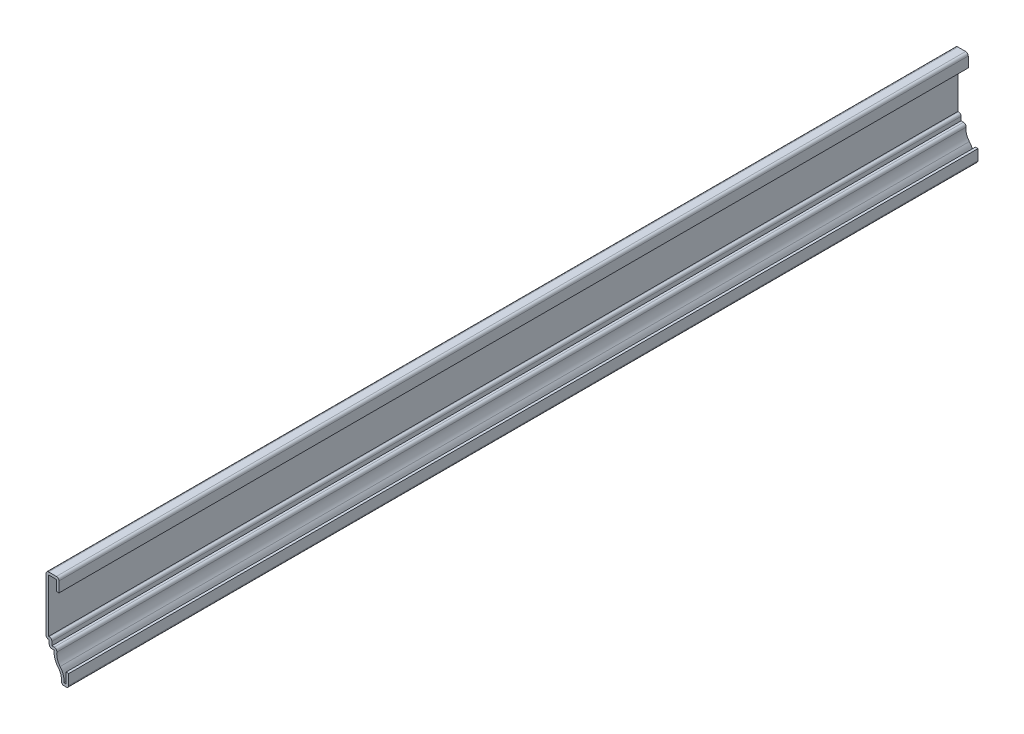
ISO-10303-21;
HEADER;
FILE_DESCRIPTION(('STEP AP214'),'2;1');
FILE_NAME('part.step','',(''),(''),'','','');
FILE_SCHEMA(('AUTOMOTIVE_DESIGN { 1 0 10303 214 1 1 1 1 }'));
ENDSEC;
DATA;
#1=APPLICATION_CONTEXT('core data for automotive mechanical design processes');
#2=APPLICATION_PROTOCOL_DEFINITION('international standard','automotive_design',2000,#1);
#3=PRODUCT_CONTEXT('',#1,'mechanical');
#4=PRODUCT('Part','Part','',(#3));
#5=PRODUCT_RELATED_PRODUCT_CATEGORY('part','',(#4));
#6=PRODUCT_DEFINITION_FORMATION('','',#4);
#7=PRODUCT_DEFINITION_CONTEXT('part definition',#1,'design');
#8=PRODUCT_DEFINITION('design','',#6,#7);
#9=PRODUCT_DEFINITION_SHAPE('','',#8);
#10=(LENGTH_UNIT() NAMED_UNIT(*) SI_UNIT(.MILLI.,.METRE.));
#11=(NAMED_UNIT(*) PLANE_ANGLE_UNIT() SI_UNIT($,.RADIAN.));
#12=(NAMED_UNIT(*) SI_UNIT($,.STERADIAN.) SOLID_ANGLE_UNIT());
#13=UNCERTAINTY_MEASURE_WITH_UNIT(LENGTH_MEASURE(1.E-05),#10,'distance_accuracy_value','');
#14=(GEOMETRIC_REPRESENTATION_CONTEXT(3) GLOBAL_UNCERTAINTY_ASSIGNED_CONTEXT((#13)) GLOBAL_UNIT_ASSIGNED_CONTEXT((#10,
#11,#12)) REPRESENTATION_CONTEXT('',''));
#15=CARTESIAN_POINT('',(0.,0.,0.));
#16=DIRECTION('',(0.,0.,1.));
#17=DIRECTION('',(1.,0.,0.));
#18=AXIS2_PLACEMENT_3D('',#15,#16,#17);
#19=CARTESIAN_POINT('',(-6.0325,44.45,-444.5));
#20=DIRECTION('',(-1.,0.,0.));
#21=DIRECTION('',(0.,-1.,0.));
#22=AXIS2_PLACEMENT_3D('',#19,#20,#21);
#23=PLANE('',#22);
#24=DIRECTION('',(0.,-1.,0.));
#25=VECTOR('',#24,1.);
#26=CARTESIAN_POINT('',(-6.0325,44.45,0.));
#27=LINE('',#26,#25);
#28=CARTESIAN_POINT('',(-6.0325,43.18,0.));
#29=VERTEX_POINT('',#28);
#30=CARTESIAN_POINT('',(-6.0325,38.1,0.));
#31=VERTEX_POINT('',#30);
#32=EDGE_CURVE('E312',#29,#31,#27,.T.);
#33=ORIENTED_EDGE('',*,*,#32,.F.);
#34=DIRECTION('',(0.,0.,1.));
#35=VECTOR('',#34,1.);
#36=CARTESIAN_POINT('',(-6.0325,43.18,-444.5));
#37=LINE('',#36,#35);
#38=CARTESIAN_POINT('',(-6.0325,43.18,-444.5));
#39=VERTEX_POINT('',#38);
#40=EDGE_CURVE('E257',#39,#29,#37,.T.);
#41=ORIENTED_EDGE('',*,*,#40,.F.);
#42=DIRECTION('',(0.,-1.,0.));
#43=VECTOR('',#42,1.);
#44=CARTESIAN_POINT('',(-6.0325,44.45,-444.5));
#45=LINE('',#44,#43);
#46=CARTESIAN_POINT('',(-6.0325,38.1,-444.5));
#47=VERTEX_POINT('',#46);
#48=EDGE_CURVE('E239',#39,#47,#45,.T.);
#49=ORIENTED_EDGE('',*,*,#48,.T.);
#50=DIRECTION('',(0.,0.,1.));
#51=VECTOR('',#50,1.);
#52=CARTESIAN_POINT('',(-6.0325,38.1,-444.5));
#53=LINE('',#52,#51);
#54=EDGE_CURVE('E247',#47,#31,#53,.T.);
#55=ORIENTED_EDGE('',*,*,#54,.T.);
#56=EDGE_LOOP('',(#33,#41,#49,#55));
#57=FACE_BOUND('',#56,.T.);
#58=ADVANCED_FACE('F35',(#57),#23,.T.);
#59=CARTESIAN_POINT('',(-11.1125,43.18,-444.5));
#60=DIRECTION('',(0.,-1.,0.));
#61=DIRECTION('',(1.,0.,0.));
#62=AXIS2_PLACEMENT_3D('',#59,#60,#61);
#63=PLANE('',#62);
#64=DIRECTION('',(1.,0.,0.));
#65=VECTOR('',#64,1.);
#66=CARTESIAN_POINT('',(-11.1125,43.18,0.));
#67=LINE('',#66,#65);
#68=CARTESIAN_POINT('',(-9.8425,43.18,0.));
#69=VERTEX_POINT('',#68);
#70=EDGE_CURVE('E258',#69,#29,#67,.T.);
#71=ORIENTED_EDGE('',*,*,#70,.F.);
#72=DIRECTION('',(0.,0.,1.));
#73=VECTOR('',#72,1.);
#74=CARTESIAN_POINT('',(-9.8425,43.18,-444.5));
#75=LINE('',#74,#73);
#76=CARTESIAN_POINT('',(-9.8425,43.18,-444.5));
#77=VERTEX_POINT('',#76);
#78=EDGE_CURVE('E365',#77,#69,#75,.T.);
#79=ORIENTED_EDGE('',*,*,#78,.F.);
#80=DIRECTION('',(1.,0.,0.));
#81=VECTOR('',#80,1.);
#82=CARTESIAN_POINT('',(-11.1125,43.18,-444.5));
#83=LINE('',#82,#81);
#84=EDGE_CURVE('E255',#77,#39,#83,.T.);
#85=ORIENTED_EDGE('',*,*,#84,.T.);
#86=ORIENTED_EDGE('',*,*,#40,.T.);
#87=EDGE_LOOP('',(#71,#79,#85,#86));
#88=FACE_BOUND('',#87,.T.);
#89=ADVANCED_FACE('F474',(#88),#63,.T.);
#90=CARTESIAN_POINT('',(-9.8425,15.875,-444.5));
#91=DIRECTION('',(1.,0.,0.));
#92=DIRECTION('',(0.,0.,-1.));
#93=AXIS2_PLACEMENT_3D('',#90,#91,#92);
#94=PLANE('',#93);
#95=DIRECTION('',(0.,1.,0.));
#96=VECTOR('',#95,1.);
#97=CARTESIAN_POINT('',(-9.8425,15.875,0.));
#98=LINE('',#97,#96);
#99=CARTESIAN_POINT('',(-9.8425,17.145,0.));
#100=VERTEX_POINT('',#99);
#101=EDGE_CURVE('E261',#100,#69,#98,.T.);
#102=ORIENTED_EDGE('',*,*,#101,.F.);
#103=DIRECTION('',(0.,0.,1.));
#104=VECTOR('',#103,1.);
#105=CARTESIAN_POINT('',(-9.8425,17.145,-444.5));
#106=LINE('',#105,#104);
#107=CARTESIAN_POINT('',(-9.8425,17.145,-444.5));
#108=VERTEX_POINT('',#107);
#109=EDGE_CURVE('E367',#108,#100,#106,.T.);
#110=ORIENTED_EDGE('',*,*,#109,.F.);
#111=DIRECTION('',(0.,1.,0.));
#112=VECTOR('',#111,1.);
#113=CARTESIAN_POINT('',(-9.8425,15.875,-444.5));
#114=LINE('',#113,#112);
#115=EDGE_CURVE('E308',#108,#77,#114,.T.);
#116=ORIENTED_EDGE('',*,*,#115,.T.);
#117=ORIENTED_EDGE('',*,*,#78,.T.);
#118=EDGE_LOOP('',(#102,#110,#116,#117));
#119=FACE_BOUND('',#118,.T.);
#120=ADVANCED_FACE('F480',(#119),#94,.T.);
#121=CARTESIAN_POINT('',(-9.525,17.145,-444.5));
#122=DIRECTION('',(0.,1.,0.));
#123=DIRECTION('',(-1.,0.,0.));
#124=AXIS2_PLACEMENT_3D('',#121,#122,#123);
#125=PLANE('',#124);
#126=DIRECTION('',(-1.,0.,0.));
#127=VECTOR('',#126,1.);
#128=CARTESIAN_POINT('',(-9.525,17.145,0.));
#129=LINE('',#128,#127);
#130=CARTESIAN_POINT('',(-9.525,17.145,0.));
#131=VERTEX_POINT('',#130);
#132=EDGE_CURVE('E359',#131,#100,#129,.T.);
#133=ORIENTED_EDGE('',*,*,#132,.F.);
#134=DIRECTION('',(0.,0.,1.));
#135=VECTOR('',#134,1.);
#136=CARTESIAN_POINT('',(-9.525,17.145,-444.5));
#137=LINE('',#136,#135);
#138=CARTESIAN_POINT('',(-9.525,17.145,-444.5));
#139=VERTEX_POINT('',#138);
#140=EDGE_CURVE('E447',#131,#139,#137,.F.);
#141=ORIENTED_EDGE('',*,*,#140,.T.);
#142=DIRECTION('',(-1.,0.,0.));
#143=VECTOR('',#142,1.);
#144=CARTESIAN_POINT('',(-9.525,17.145,-444.5));
#145=LINE('',#144,#143);
#146=EDGE_CURVE('E306',#139,#108,#145,.T.);
#147=ORIENTED_EDGE('',*,*,#146,.T.);
#148=ORIENTED_EDGE('',*,*,#109,.T.);
#149=EDGE_LOOP('',(#133,#141,#147,#148));
#150=FACE_BOUND('',#149,.T.);
#151=ADVANCED_FACE('F483',(#150),#125,.T.);
#152=CARTESIAN_POINT('',(-8.255,12.7,-444.5));
#153=DIRECTION('',(1.,0.,0.));
#154=DIRECTION('',(0.,0.,-1.));
#155=AXIS2_PLACEMENT_3D('',#152,#153,#154);
#156=PLANE('',#155);
#157=DIRECTION('',(0.,1.,0.));
#158=VECTOR('',#157,1.);
#159=CARTESIAN_POINT('',(-8.255,12.7,-444.5));
#160=LINE('',#159,#158);
#161=CARTESIAN_POINT('',(-8.255,13.97,-444.5));
#162=VERTEX_POINT('',#161);
#163=CARTESIAN_POINT('',(-8.255,15.875,-444.5));
#164=VERTEX_POINT('',#163);
#165=EDGE_CURVE('E303',#162,#164,#160,.T.);
#166=ORIENTED_EDGE('',*,*,#165,.T.);
#167=DIRECTION('',(0.,0.,1.));
#168=VECTOR('',#167,1.);
#169=CARTESIAN_POINT('',(-8.255,15.875,-444.5));
#170=LINE('',#169,#168);
#171=CARTESIAN_POINT('',(-8.255,15.875,0.));
#172=VERTEX_POINT('',#171);
#173=EDGE_CURVE('E444',#164,#172,#170,.T.);
#174=ORIENTED_EDGE('',*,*,#173,.T.);
#175=DIRECTION('',(0.,1.,0.));
#176=VECTOR('',#175,1.);
#177=CARTESIAN_POINT('',(-8.255,12.7,0.));
#178=LINE('',#177,#176);
#179=CARTESIAN_POINT('',(-8.255,13.97,0.));
#180=VERTEX_POINT('',#179);
#181=EDGE_CURVE('E356',#180,#172,#178,.T.);
#182=ORIENTED_EDGE('',*,*,#181,.F.);
#183=DIRECTION('',(0.,0.,1.));
#184=VECTOR('',#183,1.);
#185=CARTESIAN_POINT('',(-8.255,13.97,-444.5));
#186=LINE('',#185,#184);
#187=EDGE_CURVE('E370',#162,#180,#186,.T.);
#188=ORIENTED_EDGE('',*,*,#187,.F.);
#189=EDGE_LOOP('',(#166,#174,#182,#188));
#190=FACE_BOUND('',#189,.T.);
#191=ADVANCED_FACE('F492',(#190),#156,.T.);
#192=CARTESIAN_POINT('',(-7.07009939362724,13.97,-444.5));
#193=DIRECTION('',(0.,1.,0.));
#194=DIRECTION('',(0.,0.,1.));
#195=AXIS2_PLACEMENT_3D('',#192,#193,#194);
#196=PLANE('',#195);
#197=DIRECTION('',(1.,0.,0.));
#198=VECTOR('',#197,1.);
#199=CARTESIAN_POINT('',(-7.07009939362724,13.97,0.));
#200=LINE('',#199,#198);
#201=CARTESIAN_POINT('',(-7.07009939362724,13.97,0.));
#202=VERTEX_POINT('',#201);
#203=EDGE_CURVE('E354',#202,#180,#200,.F.);
#204=ORIENTED_EDGE('',*,*,#203,.F.);
#205=DIRECTION('',(0.,0.,1.));
#206=VECTOR('',#205,1.);
#207=CARTESIAN_POINT('',(-7.07009939362724,13.97,-444.5));
#208=LINE('',#207,#206);
#209=CARTESIAN_POINT('',(-7.07009939362724,13.97,-444.5));
#210=VERTEX_POINT('',#209);
#211=EDGE_CURVE('E437',#202,#210,#208,.F.);
#212=ORIENTED_EDGE('',*,*,#211,.T.);
#213=DIRECTION('',(1.,0.,0.));
#214=VECTOR('',#213,1.);
#215=CARTESIAN_POINT('',(-7.07009939362724,13.97,-444.5));
#216=LINE('',#215,#214);
#217=EDGE_CURVE('E301',#210,#162,#216,.F.);
#218=ORIENTED_EDGE('',*,*,#217,.T.);
#219=ORIENTED_EDGE('',*,*,#187,.T.);
#220=EDGE_LOOP('',(#204,#212,#218,#219));
#221=FACE_BOUND('',#220,.T.);
#222=ADVANCED_FACE('F496',(#221),#196,.T.);
#223=CARTESIAN_POINT('',(0.79375,11.6212141248846,-444.5));
#224=DIRECTION('',(0.,0.,1.));
#225=DIRECTION('',(1.,0.,0.));
#226=AXIS2_PLACEMENT_3D('',#223,#224,#225);
#227=CYLINDRICAL_SURFACE('',#226,6.6675);
#228=CARTESIAN_POINT('',(0.79375,11.6212141248846,-444.5));
#229=DIRECTION('',(0.,0.,1.));
#230=DIRECTION('',(1.,0.,0.));
#231=AXIS2_PLACEMENT_3D('',#228,#229,#230);
#232=CIRCLE('',#231,6.6675);
#233=CARTESIAN_POINT('',(-4.21157837512634,7.21641627400029,-444.5));
#234=VERTEX_POINT('',#233);
#235=CARTESIAN_POINT('',(-5.81188349064688,12.5273942599815,-444.5));
#236=VERTEX_POINT('',#235);
#237=EDGE_CURVE('E298',#234,#236,#232,.F.);
#238=ORIENTED_EDGE('',*,*,#237,.T.);
#239=DIRECTION('',(0.,0.,1.));
#240=VECTOR('',#239,1.);
#241=CARTESIAN_POINT('',(-5.81188349064688,12.5273942599815,-444.5));
#242=LINE('',#241,#240);
#243=CARTESIAN_POINT('',(-5.81188349064688,12.5273942599815,0.));
#244=VERTEX_POINT('',#243);
#245=EDGE_CURVE('E434',#236,#244,#242,.T.);
#246=ORIENTED_EDGE('',*,*,#245,.T.);
#247=CARTESIAN_POINT('',(0.79375,11.6212141248846,0.));
#248=DIRECTION('',(0.,0.,1.));
#249=DIRECTION('',(1.,0.,0.));
#250=AXIS2_PLACEMENT_3D('',#247,#248,#249);
#251=CIRCLE('',#250,6.6675);
#252=CARTESIAN_POINT('',(-4.21157837512634,7.21641627400029,0.));
#253=VERTEX_POINT('',#252);
#254=EDGE_CURVE('E351',#253,#244,#251,.F.);
#255=ORIENTED_EDGE('',*,*,#254,.F.);
#256=DIRECTION('',(0.,0.,1.));
#257=VECTOR('',#256,1.);
#258=CARTESIAN_POINT('',(-4.21157837512634,7.21641627400029,-444.5));
#259=LINE('',#258,#257);
#260=EDGE_CURVE('E373',#234,#253,#259,.T.);
#261=ORIENTED_EDGE('',*,*,#260,.F.);
#262=EDGE_LOOP('',(#238,#246,#255,#261));
#263=FACE_BOUND('',#262,.T.);
#264=ADVANCED_FACE('F505',(#263),#227,.F.);
#265=CARTESIAN_POINT('',(-9.93195366098501,2.18236158727535,-444.5));
#266=DIRECTION('',(0.,0.,1.));
#267=DIRECTION('',(1.,0.,0.));
#268=AXIS2_PLACEMENT_3D('',#265,#266,#267);
#269=CYLINDRICAL_SURFACE('',#268,7.62);
#270=CARTESIAN_POINT('',(-9.93195366098501,2.18236158727535,0.));
#271=DIRECTION('',(0.,0.,1.));
#272=DIRECTION('',(1.,0.,0.));
#273=AXIS2_PLACEMENT_3D('',#270,#271,#272);
#274=CIRCLE('',#273,7.62);
#275=CARTESIAN_POINT('',(-2.36677049505542,1.27,0.));
#276=VERTEX_POINT('',#275);
#277=EDGE_CURVE('E348',#276,#253,#274,.T.);
#278=ORIENTED_EDGE('',*,*,#277,.F.);
#279=DIRECTION('',(0.,0.,1.));
#280=VECTOR('',#279,1.);
#281=CARTESIAN_POINT('',(-2.36677049505542,1.27,-444.5));
#282=LINE('',#281,#280);
#283=CARTESIAN_POINT('',(-2.36677049505542,1.27,-444.5));
#284=VERTEX_POINT('',#283);
#285=EDGE_CURVE('E375',#284,#276,#282,.T.);
#286=ORIENTED_EDGE('',*,*,#285,.F.);
#287=CARTESIAN_POINT('',(-9.93195366098501,2.18236158727535,-444.5));
#288=DIRECTION('',(0.,0.,1.));
#289=DIRECTION('',(1.,0.,0.));
#290=AXIS2_PLACEMENT_3D('',#287,#288,#289);
#291=CIRCLE('',#290,7.62);
#292=EDGE_CURVE('E295',#284,#234,#291,.T.);
#293=ORIENTED_EDGE('',*,*,#292,.T.);
#294=ORIENTED_EDGE('',*,*,#260,.T.);
#295=EDGE_LOOP('',(#278,#286,#293,#294));
#296=FACE_BOUND('',#295,.T.);
#297=ADVANCED_FACE('F509',(#296),#269,.T.);
#298=CARTESIAN_POINT('',(0.,1.27,-444.5));
#299=DIRECTION('',(0.,1.,0.));
#300=DIRECTION('',(0.,0.,1.));
#301=AXIS2_PLACEMENT_3D('',#298,#299,#300);
#302=PLANE('',#301);
#303=DIRECTION('',(1.,0.,0.));
#304=VECTOR('',#303,1.);
#305=CARTESIAN_POINT('',(0.,1.27,0.));
#306=LINE('',#305,#304);
#307=CARTESIAN_POINT('',(-1.27,1.27,0.));
#308=VERTEX_POINT('',#307);
#309=EDGE_CURVE('E345',#308,#276,#306,.F.);
#310=ORIENTED_EDGE('',*,*,#309,.F.);
#311=DIRECTION('',(0.,0.,1.));
#312=VECTOR('',#311,1.);
#313=CARTESIAN_POINT('',(-1.27,1.27,-444.5));
#314=LINE('',#313,#312);
#315=CARTESIAN_POINT('',(-1.27,1.27,-444.5));
#316=VERTEX_POINT('',#315);
#317=EDGE_CURVE('E377',#316,#308,#314,.T.);
#318=ORIENTED_EDGE('',*,*,#317,.F.);
#319=DIRECTION('',(1.,0.,0.));
#320=VECTOR('',#319,1.);
#321=CARTESIAN_POINT('',(0.,1.27,-444.5));
#322=LINE('',#321,#320);
#323=EDGE_CURVE('E292',#316,#284,#322,.F.);
#324=ORIENTED_EDGE('',*,*,#323,.T.);
#325=ORIENTED_EDGE('',*,*,#285,.T.);
#326=EDGE_LOOP('',(#310,#318,#324,#325));
#327=FACE_BOUND('',#326,.T.);
#328=ADVANCED_FACE('F514',(#327),#302,.T.);
#329=CARTESIAN_POINT('',(-1.27,6.35,-444.5));
#330=DIRECTION('',(-1.,0.,0.));
#331=DIRECTION('',(0.,-1.,0.));
#332=AXIS2_PLACEMENT_3D('',#329,#330,#331);
#333=PLANE('',#332);
#334=DIRECTION('',(0.,-1.,0.));
#335=VECTOR('',#334,1.);
#336=CARTESIAN_POINT('',(-1.27,6.35,0.));
#337=LINE('',#336,#335);
#338=CARTESIAN_POINT('',(-1.27,6.35,0.));
#339=VERTEX_POINT('',#338);
#340=EDGE_CURVE('E342',#339,#308,#337,.T.);
#341=ORIENTED_EDGE('',*,*,#340,.F.);
#342=DIRECTION('',(0.,0.,1.));
#343=VECTOR('',#342,1.);
#344=CARTESIAN_POINT('',(-1.27,6.35,-444.5));
#345=LINE('',#344,#343);
#346=CARTESIAN_POINT('',(-1.27,6.35,-444.5));
#347=VERTEX_POINT('',#346);
#348=EDGE_CURVE('E379',#347,#339,#345,.T.);
#349=ORIENTED_EDGE('',*,*,#348,.F.);
#350=DIRECTION('',(0.,-1.,0.));
#351=VECTOR('',#350,1.);
#352=CARTESIAN_POINT('',(-1.27,6.35,-444.5));
#353=LINE('',#352,#351);
#354=EDGE_CURVE('E289',#347,#316,#353,.T.);
#355=ORIENTED_EDGE('',*,*,#354,.T.);
#356=ORIENTED_EDGE('',*,*,#317,.T.);
#357=EDGE_LOOP('',(#341,#349,#355,#356));
#358=FACE_BOUND('',#357,.T.);
#359=ADVANCED_FACE('F517',(#358),#333,.T.);
#360=CARTESIAN_POINT('',(-1.27,6.35,-444.5));
#361=DIRECTION('',(0.,-1.,0.));
#362=DIRECTION('',(0.,0.,-1.));
#363=AXIS2_PLACEMENT_3D('',#360,#361,#362);
#364=PLANE('',#363);
#365=DIRECTION('',(1.,0.,0.));
#366=VECTOR('',#365,1.);
#367=CARTESIAN_POINT('',(-1.27,6.35,0.));
#368=LINE('',#367,#366);
#369=CARTESIAN_POINT('',(0.,6.35,0.));
#370=VERTEX_POINT('',#369);
#371=EDGE_CURVE('E340',#339,#370,#368,.T.);
#372=ORIENTED_EDGE('',*,*,#371,.T.);
#373=DIRECTION('',(0.,0.,1.));
#374=VECTOR('',#373,1.);
#375=CARTESIAN_POINT('',(0.,6.35,-444.5));
#376=LINE('',#375,#374);
#377=CARTESIAN_POINT('',(0.,6.35,-444.5));
#378=VERTEX_POINT('',#377);
#379=EDGE_CURVE('E381',#378,#370,#376,.T.);
#380=ORIENTED_EDGE('',*,*,#379,.F.);
#381=DIRECTION('',(1.,0.,0.));
#382=VECTOR('',#381,1.);
#383=CARTESIAN_POINT('',(-1.27,6.35,-444.5));
#384=LINE('',#383,#382);
#385=EDGE_CURVE('E287',#347,#378,#384,.T.);
#386=ORIENTED_EDGE('',*,*,#385,.F.);
#387=ORIENTED_EDGE('',*,*,#348,.T.);
#388=EDGE_LOOP('',(#372,#380,#386,#387));
#389=FACE_BOUND('',#388,.T.);
#390=ADVANCED_FACE('F523',(#389),#364,.F.);
#391=CARTESIAN_POINT('',(0.,6.35,-444.5));
#392=DIRECTION('',(-1.,0.,0.));
#393=DIRECTION('',(0.,-1.,0.));
#394=AXIS2_PLACEMENT_3D('',#391,#392,#393);
#395=PLANE('',#394);
#396=DIRECTION('',(0.,-1.,0.));
#397=VECTOR('',#396,1.);
#398=CARTESIAN_POINT('',(0.,6.35,0.));
#399=LINE('',#398,#397);
#400=CARTESIAN_POINT('',(0.,1.27,0.));
#401=VERTEX_POINT('',#400);
#402=EDGE_CURVE('E337',#370,#401,#399,.T.);
#403=ORIENTED_EDGE('',*,*,#402,.T.);
#404=DIRECTION('',(0.,0.,1.));
#405=VECTOR('',#404,1.);
#406=CARTESIAN_POINT('',(0.,1.27,-444.5));
#407=LINE('',#406,#405);
#408=CARTESIAN_POINT('',(0.,1.27,-444.5));
#409=VERTEX_POINT('',#408);
#410=EDGE_CURVE('E414',#401,#409,#407,.F.);
#411=ORIENTED_EDGE('',*,*,#410,.T.);
#412=DIRECTION('',(0.,-1.,0.));
#413=VECTOR('',#412,1.);
#414=CARTESIAN_POINT('',(0.,6.35,-444.5));
#415=LINE('',#414,#413);
#416=EDGE_CURVE('E285',#378,#409,#415,.T.);
#417=ORIENTED_EDGE('',*,*,#416,.F.);
#418=ORIENTED_EDGE('',*,*,#379,.T.);
#419=EDGE_LOOP('',(#403,#411,#417,#418));
#420=FACE_BOUND('',#419,.T.);
#421=ADVANCED_FACE('F527',(#420),#395,.F.);
#422=CARTESIAN_POINT('',(0.,0.,-444.5));
#423=DIRECTION('',(0.,1.,0.));
#424=DIRECTION('',(0.,0.,1.));
#425=AXIS2_PLACEMENT_3D('',#422,#423,#424);
#426=PLANE('',#425);
#427=DIRECTION('',(-1.,0.,0.));
#428=VECTOR('',#427,1.);
#429=CARTESIAN_POINT('',(0.,0.,-444.5));
#430=LINE('',#429,#428);
#431=CARTESIAN_POINT('',(-1.27,0.,-444.5));
#432=VERTEX_POINT('',#431);
#433=CARTESIAN_POINT('',(-2.36677049505542,0.,-444.5));
#434=VERTEX_POINT('',#433);
#435=EDGE_CURVE('E282',#432,#434,#430,.T.);
#436=ORIENTED_EDGE('',*,*,#435,.F.);
#437=DIRECTION('',(0.,0.,1.));
#438=VECTOR('',#437,1.);
#439=CARTESIAN_POINT('',(-1.27,0.,-444.5));
#440=LINE('',#439,#438);
#441=CARTESIAN_POINT('',(-1.27,0.,0.));
#442=VERTEX_POINT('',#441);
#443=EDGE_CURVE('E395',#432,#442,#440,.T.);
#444=ORIENTED_EDGE('',*,*,#443,.T.);
#445=DIRECTION('',(-1.,0.,0.));
#446=VECTOR('',#445,1.);
#447=CARTESIAN_POINT('',(0.,0.,0.));
#448=LINE('',#447,#446);
#449=CARTESIAN_POINT('',(-2.36677049505542,0.,0.));
#450=VERTEX_POINT('',#449);
#451=EDGE_CURVE('E334',#442,#450,#448,.T.);
#452=ORIENTED_EDGE('',*,*,#451,.T.);
#453=DIRECTION('',(0.,0.,1.));
#454=VECTOR('',#453,1.);
#455=CARTESIAN_POINT('',(-2.36677049505542,0.,-444.5));
#456=LINE('',#455,#454);
#457=EDGE_CURVE('E364',#450,#434,#456,.F.);
#458=ORIENTED_EDGE('',*,*,#457,.T.);
#459=EDGE_LOOP('',(#436,#444,#452,#458));
#460=FACE_BOUND('',#459,.T.);
#461=ADVANCED_FACE('F535',(#460),#426,.F.);
#462=CARTESIAN_POINT('',(-9.93195366098501,2.18236158727535,-444.5));
#463=DIRECTION('',(0.,0.,1.));
#464=DIRECTION('',(1.,0.,0.));
#465=AXIS2_PLACEMENT_3D('',#462,#463,#464);
#466=CYLINDRICAL_SURFACE('',#465,6.35);
#467=CARTESIAN_POINT('',(-9.93195366098501,2.18236158727535,-444.5));
#468=DIRECTION('',(0.,0.,1.));
#469=DIRECTION('',(1.,0.,0.));
#470=AXIS2_PLACEMENT_3D('',#467,#468,#469);
#471=CIRCLE('',#470,6.35);
#472=CARTESIAN_POINT('',(-3.62763435604369,1.42206026454589,-444.5));
#473=VERTEX_POINT('',#472);
#474=CARTESIAN_POINT('',(-5.16497425610278,6.37740715954614,-444.5));
#475=VERTEX_POINT('',#474);
#476=EDGE_CURVE('E280',#473,#475,#471,.T.);
#477=ORIENTED_EDGE('',*,*,#476,.F.);
#478=DIRECTION('',(0.,0.,1.));
#479=VECTOR('',#478,1.);
#480=CARTESIAN_POINT('',(-3.62763435604369,1.42206026454589,-444.5));
#481=LINE('',#480,#479);
#482=CARTESIAN_POINT('',(-3.62763435604369,1.42206026454589,0.));
#483=VERTEX_POINT('',#482);
#484=EDGE_CURVE('E431',#473,#483,#481,.T.);
#485=ORIENTED_EDGE('',*,*,#484,.T.);
#486=CARTESIAN_POINT('',(-9.93195366098501,2.18236158727535,0.));
#487=DIRECTION('',(0.,0.,1.));
#488=DIRECTION('',(1.,0.,0.));
#489=AXIS2_PLACEMENT_3D('',#486,#487,#488);
#490=CIRCLE('',#489,6.35);
#491=CARTESIAN_POINT('',(-5.16497425610278,6.37740715954614,0.));
#492=VERTEX_POINT('',#491);
#493=EDGE_CURVE('E332',#483,#492,#490,.T.);
#494=ORIENTED_EDGE('',*,*,#493,.T.);
#495=DIRECTION('',(0.,0.,1.));
#496=VECTOR('',#495,1.);
#497=CARTESIAN_POINT('',(-5.16497425610278,6.37740715954614,-444.5));
#498=LINE('',#497,#496);
#499=EDGE_CURVE('E384',#475,#492,#498,.T.);
#500=ORIENTED_EDGE('',*,*,#499,.F.);
#501=EDGE_LOOP('',(#477,#485,#494,#500));
#502=FACE_BOUND('',#501,.T.);
#503=ADVANCED_FACE('F543',(#502),#466,.F.);
#504=CARTESIAN_POINT('',(0.79375,11.6212141248846,-444.5));
#505=DIRECTION('',(0.,0.,1.));
#506=DIRECTION('',(1.,0.,0.));
#507=AXIS2_PLACEMENT_3D('',#504,#505,#506);
#508=CYLINDRICAL_SURFACE('',#507,7.9375);
#509=CARTESIAN_POINT('',(0.79375,11.6212141248846,0.));
#510=DIRECTION('',(0.,0.,-1.));
#511=DIRECTION('',(-1.,0.,0.));
#512=AXIS2_PLACEMENT_3D('',#509,#510,#511);
#513=CIRCLE('',#512,7.9375);
#514=CARTESIAN_POINT('',(-7.07009939362724,12.7,0.));
#515=VERTEX_POINT('',#514);
#516=EDGE_CURVE('E330',#492,#515,#513,.T.);
#517=ORIENTED_EDGE('',*,*,#516,.T.);
#518=DIRECTION('',(0.,0.,1.));
#519=VECTOR('',#518,1.);
#520=CARTESIAN_POINT('',(-7.07009939362724,12.7,-444.5));
#521=LINE('',#520,#519);
#522=CARTESIAN_POINT('',(-7.07009939362724,12.7,-444.5));
#523=VERTEX_POINT('',#522);
#524=EDGE_CURVE('E387',#523,#515,#521,.T.);
#525=ORIENTED_EDGE('',*,*,#524,.F.);
#526=CARTESIAN_POINT('',(0.79375,11.6212141248846,-444.5));
#527=DIRECTION('',(0.,0.,-1.));
#528=DIRECTION('',(-1.,0.,0.));
#529=AXIS2_PLACEMENT_3D('',#526,#527,#528);
#530=CIRCLE('',#529,7.9375);
#531=EDGE_CURVE('E278',#475,#523,#530,.T.);
#532=ORIENTED_EDGE('',*,*,#531,.F.);
#533=ORIENTED_EDGE('',*,*,#499,.T.);
#534=EDGE_LOOP('',(#517,#525,#532,#533));
#535=FACE_BOUND('',#534,.T.);
#536=ADVANCED_FACE('F549',(#535),#508,.T.);
#537=CARTESIAN_POINT('',(-7.07009939362724,12.7,-444.5));
#538=DIRECTION('',(0.,1.,0.));
#539=DIRECTION('',(0.,0.,1.));
#540=AXIS2_PLACEMENT_3D('',#537,#538,#539);
#541=PLANE('',#540);
#542=DIRECTION('',(-1.,0.,0.));
#543=VECTOR('',#542,1.);
#544=CARTESIAN_POINT('',(-7.07009939362724,12.7,0.));
#545=LINE('',#544,#543);
#546=CARTESIAN_POINT('',(-8.255,12.7,0.));
#547=VERTEX_POINT('',#546);
#548=EDGE_CURVE('E327',#515,#547,#545,.T.);
#549=ORIENTED_EDGE('',*,*,#548,.T.);
#550=DIRECTION('',(0.,0.,1.));
#551=VECTOR('',#550,1.);
#552=CARTESIAN_POINT('',(-8.255,12.7,-444.5));
#553=LINE('',#552,#551);
#554=CARTESIAN_POINT('',(-8.255,12.7,-444.5));
#555=VERTEX_POINT('',#554);
#556=EDGE_CURVE('E442',#547,#555,#553,.F.);
#557=ORIENTED_EDGE('',*,*,#556,.T.);
#558=DIRECTION('',(-1.,0.,0.));
#559=VECTOR('',#558,1.);
#560=CARTESIAN_POINT('',(-7.07009939362724,12.7,-444.5));
#561=LINE('',#560,#559);
#562=EDGE_CURVE('E275',#523,#555,#561,.T.);
#563=ORIENTED_EDGE('',*,*,#562,.F.);
#564=ORIENTED_EDGE('',*,*,#524,.T.);
#565=EDGE_LOOP('',(#549,#557,#563,#564));
#566=FACE_BOUND('',#565,.T.);
#567=ADVANCED_FACE('F700',(#566),#541,.F.);
#568=CARTESIAN_POINT('',(-9.525,12.7,-444.5));
#569=DIRECTION('',(1.,0.,0.));
#570=DIRECTION('',(0.,0.,-1.));
#571=AXIS2_PLACEMENT_3D('',#568,#569,#570);
#572=PLANE('',#571);
#573=DIRECTION('',(0.,1.,0.));
#574=VECTOR('',#573,1.);
#575=CARTESIAN_POINT('',(-9.525,12.7,-444.5));
#576=LINE('',#575,#574);
#577=CARTESIAN_POINT('',(-9.525,13.97,-444.5));
#578=VERTEX_POINT('',#577);
#579=CARTESIAN_POINT('',(-9.525,15.875,-444.5));
#580=VERTEX_POINT('',#579);
#581=EDGE_CURVE('E273',#578,#580,#576,.T.);
#582=ORIENTED_EDGE('',*,*,#581,.F.);
#583=DIRECTION('',(0.,0.,1.));
#584=VECTOR('',#583,1.);
#585=CARTESIAN_POINT('',(-9.525,13.97,-444.5));
#586=LINE('',#585,#584);
#587=CARTESIAN_POINT('',(-9.525,13.97,0.));
#588=VERTEX_POINT('',#587);
#589=EDGE_CURVE('E439',#578,#588,#586,.T.);
#590=ORIENTED_EDGE('',*,*,#589,.T.);
#591=DIRECTION('',(0.,1.,0.));
#592=VECTOR('',#591,1.);
#593=CARTESIAN_POINT('',(-9.525,12.7,0.));
#594=LINE('',#593,#592);
#595=CARTESIAN_POINT('',(-9.525,15.875,0.));
#596=VERTEX_POINT('',#595);
#597=EDGE_CURVE('E325',#588,#596,#594,.T.);
#598=ORIENTED_EDGE('',*,*,#597,.T.);
#599=DIRECTION('',(0.,0.,1.));
#600=VECTOR('',#599,1.);
#601=CARTESIAN_POINT('',(-9.525,15.875,-444.5));
#602=LINE('',#601,#600);
#603=EDGE_CURVE('E390',#580,#596,#602,.T.);
#604=ORIENTED_EDGE('',*,*,#603,.F.);
#605=EDGE_LOOP('',(#582,#590,#598,#604));
#606=FACE_BOUND('',#605,.T.);
#607=ADVANCED_FACE('F560',(#606),#572,.F.);
#608=CARTESIAN_POINT('',(-9.525,15.875,-444.5));
#609=DIRECTION('',(0.,1.,0.));
#610=DIRECTION('',(-1.,0.,0.));
#611=AXIS2_PLACEMENT_3D('',#608,#609,#610);
#612=PLANE('',#611);
#613=DIRECTION('',(-1.,0.,0.));
#614=VECTOR('',#613,1.);
#615=CARTESIAN_POINT('',(-9.525,15.875,0.));
#616=LINE('',#615,#614);
#617=CARTESIAN_POINT('',(-9.8425,15.875,0.));
#618=VERTEX_POINT('',#617);
#619=EDGE_CURVE('E322',#596,#618,#616,.T.);
#620=ORIENTED_EDGE('',*,*,#619,.T.);
#621=DIRECTION('',(0.,0.,1.));
#622=VECTOR('',#621,1.);
#623=CARTESIAN_POINT('',(-9.8425,15.875,-444.5));
#624=LINE('',#623,#622);
#625=CARTESIAN_POINT('',(-9.8425,15.875,-444.5));
#626=VERTEX_POINT('',#625);
#627=EDGE_CURVE('E454',#618,#626,#624,.F.);
#628=ORIENTED_EDGE('',*,*,#627,.T.);
#629=DIRECTION('',(-1.,0.,0.));
#630=VECTOR('',#629,1.);
#631=CARTESIAN_POINT('',(-9.525,15.875,-444.5));
#632=LINE('',#631,#630);
#633=EDGE_CURVE('E270',#580,#626,#632,.T.);
#634=ORIENTED_EDGE('',*,*,#633,.F.);
#635=ORIENTED_EDGE('',*,*,#603,.T.);
#636=EDGE_LOOP('',(#620,#628,#634,#635));
#637=FACE_BOUND('',#636,.T.);
#638=ADVANCED_FACE('F566',(#637),#612,.F.);
#639=CARTESIAN_POINT('',(-11.1125,15.875,-444.5));
#640=DIRECTION('',(1.,0.,0.));
#641=DIRECTION('',(0.,0.,-1.));
#642=AXIS2_PLACEMENT_3D('',#639,#640,#641);
#643=PLANE('',#642);
#644=DIRECTION('',(0.,1.,0.));
#645=VECTOR('',#644,1.);
#646=CARTESIAN_POINT('',(-11.1125,15.875,-444.5));
#647=LINE('',#646,#645);
#648=CARTESIAN_POINT('',(-11.1125,17.145,-444.5));
#649=VERTEX_POINT('',#648);
#650=CARTESIAN_POINT('',(-11.1125,43.18,-444.5));
#651=VERTEX_POINT('',#650);
#652=EDGE_CURVE('E267',#649,#651,#647,.T.);
#653=ORIENTED_EDGE('',*,*,#652,.F.);
#654=DIRECTION('',(0.,0.,1.));
#655=VECTOR('',#654,1.);
#656=CARTESIAN_POINT('',(-11.1125,17.145,-444.5));
#657=LINE('',#656,#655);
#658=CARTESIAN_POINT('',(-11.1125,17.145,0.));
#659=VERTEX_POINT('',#658);
#660=EDGE_CURVE('E451',#649,#659,#657,.T.);
#661=ORIENTED_EDGE('',*,*,#660,.T.);
#662=DIRECTION('',(0.,1.,0.));
#663=VECTOR('',#662,1.);
#664=CARTESIAN_POINT('',(-11.1125,15.875,0.));
#665=LINE('',#664,#663);
#666=CARTESIAN_POINT('',(-11.1125,43.18,0.));
#667=VERTEX_POINT('',#666);
#668=EDGE_CURVE('E319',#659,#667,#665,.T.);
#669=ORIENTED_EDGE('',*,*,#668,.T.);
#670=DIRECTION('',(0.,0.,1.));
#671=VECTOR('',#670,1.);
#672=CARTESIAN_POINT('',(-11.1125,43.18,-444.5));
#673=LINE('',#672,#671);
#674=EDGE_CURVE('E449',#667,#651,#673,.F.);
#675=ORIENTED_EDGE('',*,*,#674,.T.);
#676=EDGE_LOOP('',(#653,#661,#669,#675));
#677=FACE_BOUND('',#676,.T.);
#678=ADVANCED_FACE('F574',(#677),#643,.F.);
#679=CARTESIAN_POINT('',(-11.1125,44.45,-444.5));
#680=DIRECTION('',(0.,-1.,0.));
#681=DIRECTION('',(1.,0.,0.));
#682=AXIS2_PLACEMENT_3D('',#679,#680,#681);
#683=PLANE('',#682);
#684=DIRECTION('',(1.,0.,0.));
#685=VECTOR('',#684,1.);
#686=CARTESIAN_POINT('',(-11.1125,44.45,-444.5));
#687=LINE('',#686,#685);
#688=CARTESIAN_POINT('',(-9.8425,44.45,-444.5));
#689=VERTEX_POINT('',#688);
#690=CARTESIAN_POINT('',(-6.0325,44.45,-444.5));
#691=VERTEX_POINT('',#690);
#692=EDGE_CURVE('E265',#689,#691,#687,.T.);
#693=ORIENTED_EDGE('',*,*,#692,.F.);
#694=DIRECTION('',(0.,0.,1.));
#695=VECTOR('',#694,1.);
#696=CARTESIAN_POINT('',(-9.8425,44.45,-444.5));
#697=LINE('',#696,#695);
#698=CARTESIAN_POINT('',(-9.8425,44.45,0.));
#699=VERTEX_POINT('',#698);
#700=EDGE_CURVE('E43',#689,#699,#697,.T.);
#701=ORIENTED_EDGE('',*,*,#700,.T.);
#702=DIRECTION('',(1.,0.,0.));
#703=VECTOR('',#702,1.);
#704=CARTESIAN_POINT('',(-11.1125,44.45,0.));
#705=LINE('',#704,#703);
#706=CARTESIAN_POINT('',(-6.0325,44.45,0.));
#707=VERTEX_POINT('',#706);
#708=EDGE_CURVE('E317',#699,#707,#705,.T.);
#709=ORIENTED_EDGE('',*,*,#708,.T.);
#710=DIRECTION('',(0.,0.,1.));
#711=VECTOR('',#710,1.);
#712=CARTESIAN_POINT('',(-6.0325,44.45,-444.5));
#713=LINE('',#712,#711);
#714=EDGE_CURVE('E58',#707,#691,#713,.F.);
#715=ORIENTED_EDGE('',*,*,#714,.T.);
#716=EDGE_LOOP('',(#693,#701,#709,#715));
#717=FACE_BOUND('',#716,.T.);
#718=ADVANCED_FACE('F459',(#717),#683,.F.);
#719=CARTESIAN_POINT('',(-4.7625,44.45,-444.5));
#720=DIRECTION('',(-1.,0.,0.));
#721=DIRECTION('',(0.,-1.,0.));
#722=AXIS2_PLACEMENT_3D('',#719,#720,#721);
#723=PLANE('',#722);
#724=DIRECTION('',(0.,-1.,0.));
#725=VECTOR('',#724,1.);
#726=CARTESIAN_POINT('',(-4.7625,44.45,-444.5));
#727=LINE('',#726,#725);
#728=CARTESIAN_POINT('',(-4.7625,43.18,-444.5));
#729=VERTEX_POINT('',#728);
#730=CARTESIAN_POINT('',(-4.7625,38.1,-444.5));
#731=VERTEX_POINT('',#730);
#732=EDGE_CURVE('E241',#729,#731,#727,.T.);
#733=ORIENTED_EDGE('',*,*,#732,.F.);
#734=DIRECTION('',(0.,0.,1.));
#735=VECTOR('',#734,1.);
#736=CARTESIAN_POINT('',(-4.7625,43.18,-444.5));
#737=LINE('',#736,#735);
#738=CARTESIAN_POINT('',(-4.7625,43.18,0.));
#739=VERTEX_POINT('',#738);
#740=EDGE_CURVE('E11',#729,#739,#737,.T.);
#741=ORIENTED_EDGE('',*,*,#740,.T.);
#742=DIRECTION('',(0.,-1.,0.));
#743=VECTOR('',#742,1.);
#744=CARTESIAN_POINT('',(-4.7625,44.45,0.));
#745=LINE('',#744,#743);
#746=CARTESIAN_POINT('',(-4.7625,38.1,0.));
#747=VERTEX_POINT('',#746);
#748=EDGE_CURVE('E315',#739,#747,#745,.T.);
#749=ORIENTED_EDGE('',*,*,#748,.T.);
#750=DIRECTION('',(0.,0.,1.));
#751=VECTOR('',#750,1.);
#752=CARTESIAN_POINT('',(-4.7625,38.1,-444.5));
#753=LINE('',#752,#751);
#754=EDGE_CURVE('E254',#731,#747,#753,.T.);
#755=ORIENTED_EDGE('',*,*,#754,.F.);
#756=EDGE_LOOP('',(#733,#741,#749,#755));
#757=FACE_BOUND('',#756,.T.);
#758=ADVANCED_FACE('F470',(#757),#723,.F.);
#759=CARTESIAN_POINT('',(-4.7625,38.1,-444.5));
#760=DIRECTION('',(0.,1.,0.));
#761=DIRECTION('',(0.,0.,1.));
#762=AXIS2_PLACEMENT_3D('',#759,#760,#761);
#763=PLANE('',#762);
#764=DIRECTION('',(-1.,0.,0.));
#765=VECTOR('',#764,1.);
#766=CARTESIAN_POINT('',(-4.7625,38.1,0.));
#767=LINE('',#766,#765);
#768=EDGE_CURVE('E250',#747,#31,#767,.T.);
#769=ORIENTED_EDGE('',*,*,#768,.T.);
#770=ORIENTED_EDGE('',*,*,#54,.F.);
#771=DIRECTION('',(-1.,0.,0.));
#772=VECTOR('',#771,1.);
#773=CARTESIAN_POINT('',(-4.7625,38.1,-444.5));
#774=LINE('',#773,#772);
#775=EDGE_CURVE('E233',#731,#47,#774,.T.);
#776=ORIENTED_EDGE('',*,*,#775,.F.);
#777=ORIENTED_EDGE('',*,*,#754,.T.);
#778=EDGE_LOOP('',(#769,#770,#776,#777));
#779=FACE_BOUND('',#778,.T.);
#780=ADVANCED_FACE('F248',(#779),#763,.F.);
#781=CARTESIAN_POINT('',(0.79375,11.6212141248846,-444.5));
#782=DIRECTION('',(0.,0.,-1.));
#783=DIRECTION('',(-1.,0.,0.));
#784=AXIS2_PLACEMENT_3D('',#781,#782,#783);
#785=PLANE('',#784);
#786=ORIENTED_EDGE('',*,*,#416,.T.);
#787=CARTESIAN_POINT('',(-1.27,1.27,-444.5));
#788=DIRECTION('',(0.,0.,-1.));
#789=DIRECTION('',(-1.,0.,0.));
#790=AXIS2_PLACEMENT_3D('',#787,#788,#789);
#791=CIRCLE('',#790,1.27);
#792=EDGE_CURVE('E429',#409,#432,#791,.T.);
#793=ORIENTED_EDGE('',*,*,#792,.T.);
#794=ORIENTED_EDGE('',*,*,#435,.T.);
#795=CARTESIAN_POINT('',(-2.36677049505542,1.27,-444.5));
#796=DIRECTION('',(0.,0.,-1.));
#797=DIRECTION('',(-1.,0.,0.));
#798=AXIS2_PLACEMENT_3D('',#795,#796,#797);
#799=CIRCLE('',#798,1.27);
#800=EDGE_CURVE('E427',#434,#473,#799,.T.);
#801=ORIENTED_EDGE('',*,*,#800,.T.);
#802=ORIENTED_EDGE('',*,*,#476,.T.);
#803=ORIENTED_EDGE('',*,*,#531,.T.);
#804=ORIENTED_EDGE('',*,*,#562,.T.);
#805=CARTESIAN_POINT('',(-8.255,13.97,-444.5));
#806=DIRECTION('',(0.,0.,-1.));
#807=DIRECTION('',(-1.,0.,0.));
#808=AXIS2_PLACEMENT_3D('',#805,#806,#807);
#809=CIRCLE('',#808,1.27);
#810=EDGE_CURVE('E423',#555,#578,#809,.T.);
#811=ORIENTED_EDGE('',*,*,#810,.T.);
#812=ORIENTED_EDGE('',*,*,#581,.T.);
#813=ORIENTED_EDGE('',*,*,#633,.T.);
#814=CARTESIAN_POINT('',(-9.8425,17.145,-444.5));
#815=DIRECTION('',(0.,0.,-1.));
#816=DIRECTION('',(-1.,0.,0.));
#817=AXIS2_PLACEMENT_3D('',#814,#815,#816);
#818=CIRCLE('',#817,1.27);
#819=EDGE_CURVE('E419',#626,#649,#818,.T.);
#820=ORIENTED_EDGE('',*,*,#819,.T.);
#821=ORIENTED_EDGE('',*,*,#652,.T.);
#822=CARTESIAN_POINT('',(-9.8425,43.18,-444.5));
#823=DIRECTION('',(0.,0.,-1.));
#824=DIRECTION('',(-1.,0.,0.));
#825=AXIS2_PLACEMENT_3D('',#822,#823,#824);
#826=CIRCLE('',#825,1.27);
#827=EDGE_CURVE('E417',#651,#689,#826,.T.);
#828=ORIENTED_EDGE('',*,*,#827,.T.);
#829=ORIENTED_EDGE('',*,*,#692,.T.);
#830=CARTESIAN_POINT('',(-6.0325,43.18,-444.5));
#831=DIRECTION('',(0.,0.,-1.));
#832=DIRECTION('',(-1.,0.,0.));
#833=AXIS2_PLACEMENT_3D('',#830,#831,#832);
#834=CIRCLE('',#833,1.27);
#835=EDGE_CURVE('E50',#691,#729,#834,.T.);
#836=ORIENTED_EDGE('',*,*,#835,.T.);
#837=ORIENTED_EDGE('',*,*,#732,.T.);
#838=ORIENTED_EDGE('',*,*,#775,.T.);
#839=ORIENTED_EDGE('',*,*,#48,.F.);
#840=ORIENTED_EDGE('',*,*,#84,.F.);
#841=ORIENTED_EDGE('',*,*,#115,.F.);
#842=ORIENTED_EDGE('',*,*,#146,.F.);
#843=CARTESIAN_POINT('',(-9.525,15.875,-444.5));
#844=DIRECTION('',(0.,0.,-1.));
#845=DIRECTION('',(-1.,0.,0.));
#846=AXIS2_PLACEMENT_3D('',#843,#844,#845);
#847=CIRCLE('',#846,1.27);
#848=EDGE_CURVE('E421',#139,#164,#847,.T.);
#849=ORIENTED_EDGE('',*,*,#848,.T.);
#850=ORIENTED_EDGE('',*,*,#165,.F.);
#851=ORIENTED_EDGE('',*,*,#217,.F.);
#852=CARTESIAN_POINT('',(-7.07009939362724,12.7,-444.5));
#853=DIRECTION('',(0.,0.,-1.));
#854=DIRECTION('',(-1.,0.,0.));
#855=AXIS2_PLACEMENT_3D('',#852,#853,#854);
#856=CIRCLE('',#855,1.27);
#857=EDGE_CURVE('E425',#210,#236,#856,.T.);
#858=ORIENTED_EDGE('',*,*,#857,.T.);
#859=ORIENTED_EDGE('',*,*,#237,.F.);
#860=ORIENTED_EDGE('',*,*,#292,.F.);
#861=ORIENTED_EDGE('',*,*,#323,.F.);
#862=ORIENTED_EDGE('',*,*,#354,.F.);
#863=ORIENTED_EDGE('',*,*,#385,.T.);
#864=EDGE_LOOP('',(#786,#793,#794,#801,#802,#803,#804,#811,#812,#813,#820,#821,#828,#829,#836,
#837,#838,#839,#840,#841,#842,#849,#850,#851,#858,#859,#860,#861,#862,#863));
#865=FACE_BOUND('',#864,.T.);
#866=ADVANCED_FACE('F236',(#865),#785,.T.);
#867=CARTESIAN_POINT('',(0.79375,11.6212141248846,0.));
#868=DIRECTION('',(0.,0.,-1.));
#869=DIRECTION('',(-1.,0.,0.));
#870=AXIS2_PLACEMENT_3D('',#867,#868,#869);
#871=PLANE('',#870);
#872=ORIENTED_EDGE('',*,*,#451,.F.);
#873=CARTESIAN_POINT('',(-1.27,1.27,0.));
#874=DIRECTION('',(0.,0.,-1.));
#875=DIRECTION('',(-1.,0.,0.));
#876=AXIS2_PLACEMENT_3D('',#873,#874,#875);
#877=CIRCLE('',#876,1.27);
#878=EDGE_CURVE('E412',#442,#401,#877,.F.);
#879=ORIENTED_EDGE('',*,*,#878,.T.);
#880=ORIENTED_EDGE('',*,*,#402,.F.);
#881=ORIENTED_EDGE('',*,*,#371,.F.);
#882=ORIENTED_EDGE('',*,*,#340,.T.);
#883=ORIENTED_EDGE('',*,*,#309,.T.);
#884=ORIENTED_EDGE('',*,*,#277,.T.);
#885=ORIENTED_EDGE('',*,*,#254,.T.);
#886=CARTESIAN_POINT('',(-7.07009939362724,12.7,0.));
#887=DIRECTION('',(0.,0.,-1.));
#888=DIRECTION('',(-1.,0.,0.));
#889=AXIS2_PLACEMENT_3D('',#886,#887,#888);
#890=CIRCLE('',#889,1.27);
#891=EDGE_CURVE('E408',#244,#202,#890,.F.);
#892=ORIENTED_EDGE('',*,*,#891,.T.);
#893=ORIENTED_EDGE('',*,*,#203,.T.);
#894=ORIENTED_EDGE('',*,*,#181,.T.);
#895=CARTESIAN_POINT('',(-9.525,15.875,0.));
#896=DIRECTION('',(0.,0.,-1.));
#897=DIRECTION('',(-1.,0.,0.));
#898=AXIS2_PLACEMENT_3D('',#895,#896,#897);
#899=CIRCLE('',#898,1.27);
#900=EDGE_CURVE('E404',#172,#131,#899,.F.);
#901=ORIENTED_EDGE('',*,*,#900,.T.);
#902=ORIENTED_EDGE('',*,*,#132,.T.);
#903=ORIENTED_EDGE('',*,*,#101,.T.);
#904=ORIENTED_EDGE('',*,*,#70,.T.);
#905=ORIENTED_EDGE('',*,*,#32,.T.);
#906=ORIENTED_EDGE('',*,*,#768,.F.);
#907=ORIENTED_EDGE('',*,*,#748,.F.);
#908=CARTESIAN_POINT('',(-6.0325,43.18,0.));
#909=DIRECTION('',(0.,0.,-1.));
#910=DIRECTION('',(-1.,0.,0.));
#911=AXIS2_PLACEMENT_3D('',#908,#909,#910);
#912=CIRCLE('',#911,1.27);
#913=EDGE_CURVE('E398',#739,#707,#912,.F.);
#914=ORIENTED_EDGE('',*,*,#913,.T.);
#915=ORIENTED_EDGE('',*,*,#708,.F.);
#916=CARTESIAN_POINT('',(-9.8425,43.18,0.));
#917=DIRECTION('',(0.,0.,-1.));
#918=DIRECTION('',(-1.,0.,0.));
#919=AXIS2_PLACEMENT_3D('',#916,#917,#918);
#920=CIRCLE('',#919,1.27);
#921=EDGE_CURVE('E400',#699,#667,#920,.F.);
#922=ORIENTED_EDGE('',*,*,#921,.T.);
#923=ORIENTED_EDGE('',*,*,#668,.F.);
#924=CARTESIAN_POINT('',(-9.8425,17.145,0.));
#925=DIRECTION('',(0.,0.,-1.));
#926=DIRECTION('',(-1.,0.,0.));
#927=AXIS2_PLACEMENT_3D('',#924,#925,#926);
#928=CIRCLE('',#927,1.27);
#929=EDGE_CURVE('E402',#659,#618,#928,.F.);
#930=ORIENTED_EDGE('',*,*,#929,.T.);
#931=ORIENTED_EDGE('',*,*,#619,.F.);
#932=ORIENTED_EDGE('',*,*,#597,.F.);
#933=CARTESIAN_POINT('',(-8.255,13.97,0.));
#934=DIRECTION('',(0.,0.,-1.));
#935=DIRECTION('',(-1.,0.,0.));
#936=AXIS2_PLACEMENT_3D('',#933,#934,#935);
#937=CIRCLE('',#936,1.27);
#938=EDGE_CURVE('E406',#588,#547,#937,.F.);
#939=ORIENTED_EDGE('',*,*,#938,.T.);
#940=ORIENTED_EDGE('',*,*,#548,.F.);
#941=ORIENTED_EDGE('',*,*,#516,.F.);
#942=ORIENTED_EDGE('',*,*,#493,.F.);
#943=CARTESIAN_POINT('',(-2.36677049505542,1.27,0.));
#944=DIRECTION('',(0.,0.,-1.));
#945=DIRECTION('',(-1.,0.,0.));
#946=AXIS2_PLACEMENT_3D('',#943,#944,#945);
#947=CIRCLE('',#946,1.27);
#948=EDGE_CURVE('E410',#483,#450,#947,.F.);
#949=ORIENTED_EDGE('',*,*,#948,.T.);
#950=EDGE_LOOP('',(#872,#879,#880,#881,#882,#883,#884,#885,#892,#893,#894,#901,#902,#903,#904,
#905,#906,#907,#914,#915,#922,#923,#930,#931,#932,#939,#940,#941,#942,#949));
#951=FACE_BOUND('',#950,.T.);
#952=ADVANCED_FACE('F464',(#951),#871,.F.);
#953=CARTESIAN_POINT('',(-1.27,1.27,-444.5));
#954=DIRECTION('',(0.,0.,1.));
#955=DIRECTION('',(1.,0.,0.));
#956=AXIS2_PLACEMENT_3D('',#953,#954,#955);
#957=CYLINDRICAL_SURFACE('',#956,1.27);
#958=ORIENTED_EDGE('',*,*,#792,.F.);
#959=ORIENTED_EDGE('',*,*,#410,.F.);
#960=ORIENTED_EDGE('',*,*,#878,.F.);
#961=ORIENTED_EDGE('',*,*,#443,.F.);
#962=EDGE_LOOP('',(#958,#959,#960,#961));
#963=FACE_BOUND('',#962,.T.);
#964=ADVANCED_FACE('F530',(#963),#957,.T.);
#965=CARTESIAN_POINT('',(-2.36677049505542,1.27,-444.5));
#966=DIRECTION('',(0.,0.,1.));
#967=DIRECTION('',(1.,0.,0.));
#968=AXIS2_PLACEMENT_3D('',#965,#966,#967);
#969=CYLINDRICAL_SURFACE('',#968,1.27);
#970=ORIENTED_EDGE('',*,*,#800,.F.);
#971=ORIENTED_EDGE('',*,*,#457,.F.);
#972=ORIENTED_EDGE('',*,*,#948,.F.);
#973=ORIENTED_EDGE('',*,*,#484,.F.);
#974=EDGE_LOOP('',(#970,#971,#972,#973));
#975=FACE_BOUND('',#974,.T.);
#976=ADVANCED_FACE('F538',(#975),#969,.T.);
#977=CARTESIAN_POINT('',(-7.07009939362724,12.7,-444.5));
#978=DIRECTION('',(0.,0.,1.));
#979=DIRECTION('',(1.,0.,0.));
#980=AXIS2_PLACEMENT_3D('',#977,#978,#979);
#981=CYLINDRICAL_SURFACE('',#980,1.27);
#982=ORIENTED_EDGE('',*,*,#857,.F.);
#983=ORIENTED_EDGE('',*,*,#211,.F.);
#984=ORIENTED_EDGE('',*,*,#891,.F.);
#985=ORIENTED_EDGE('',*,*,#245,.F.);
#986=EDGE_LOOP('',(#982,#983,#984,#985));
#987=FACE_BOUND('',#986,.T.);
#988=ADVANCED_FACE('F502',(#987),#981,.T.);
#989=CARTESIAN_POINT('',(-8.255,13.97,-444.5));
#990=DIRECTION('',(0.,0.,1.));
#991=DIRECTION('',(1.,0.,0.));
#992=AXIS2_PLACEMENT_3D('',#989,#990,#991);
#993=CYLINDRICAL_SURFACE('',#992,1.27);
#994=ORIENTED_EDGE('',*,*,#810,.F.);
#995=ORIENTED_EDGE('',*,*,#556,.F.);
#996=ORIENTED_EDGE('',*,*,#938,.F.);
#997=ORIENTED_EDGE('',*,*,#589,.F.);
#998=EDGE_LOOP('',(#994,#995,#996,#997));
#999=FACE_BOUND('',#998,.T.);
#1000=ADVANCED_FACE('F557',(#999),#993,.T.);
#1001=CARTESIAN_POINT('',(-9.525,15.875,-444.5));
#1002=DIRECTION('',(0.,0.,1.));
#1003=DIRECTION('',(1.,0.,0.));
#1004=AXIS2_PLACEMENT_3D('',#1001,#1002,#1003);
#1005=CYLINDRICAL_SURFACE('',#1004,1.27);
#1006=ORIENTED_EDGE('',*,*,#848,.F.);
#1007=ORIENTED_EDGE('',*,*,#140,.F.);
#1008=ORIENTED_EDGE('',*,*,#900,.F.);
#1009=ORIENTED_EDGE('',*,*,#173,.F.);
#1010=EDGE_LOOP('',(#1006,#1007,#1008,#1009));
#1011=FACE_BOUND('',#1010,.T.);
#1012=ADVANCED_FACE('F486',(#1011),#1005,.T.);
#1013=CARTESIAN_POINT('',(-9.8425,17.145,-444.5));
#1014=DIRECTION('',(0.,0.,1.));
#1015=DIRECTION('',(1.,0.,0.));
#1016=AXIS2_PLACEMENT_3D('',#1013,#1014,#1015);
#1017=CYLINDRICAL_SURFACE('',#1016,1.27);
#1018=ORIENTED_EDGE('',*,*,#819,.F.);
#1019=ORIENTED_EDGE('',*,*,#627,.F.);
#1020=ORIENTED_EDGE('',*,*,#929,.F.);
#1021=ORIENTED_EDGE('',*,*,#660,.F.);
#1022=EDGE_LOOP('',(#1018,#1019,#1020,#1021));
#1023=FACE_BOUND('',#1022,.T.);
#1024=ADVANCED_FACE('F570',(#1023),#1017,.T.);
#1025=CARTESIAN_POINT('',(-9.8425,43.18,-444.5));
#1026=DIRECTION('',(0.,0.,1.));
#1027=DIRECTION('',(1.,0.,0.));
#1028=AXIS2_PLACEMENT_3D('',#1025,#1026,#1027);
#1029=CYLINDRICAL_SURFACE('',#1028,1.27);
#1030=ORIENTED_EDGE('',*,*,#827,.F.);
#1031=ORIENTED_EDGE('',*,*,#674,.F.);
#1032=ORIENTED_EDGE('',*,*,#921,.F.);
#1033=ORIENTED_EDGE('',*,*,#700,.F.);
#1034=EDGE_LOOP('',(#1030,#1031,#1032,#1033));
#1035=FACE_BOUND('',#1034,.T.);
#1036=ADVANCED_FACE('F576',(#1035),#1029,.T.);
#1037=CARTESIAN_POINT('',(-6.0325,43.18,-444.5));
#1038=DIRECTION('',(0.,0.,1.));
#1039=DIRECTION('',(1.,0.,0.));
#1040=AXIS2_PLACEMENT_3D('',#1037,#1038,#1039);
#1041=CYLINDRICAL_SURFACE('',#1040,1.27);
#1042=ORIENTED_EDGE('',*,*,#835,.F.);
#1043=ORIENTED_EDGE('',*,*,#714,.F.);
#1044=ORIENTED_EDGE('',*,*,#913,.F.);
#1045=ORIENTED_EDGE('',*,*,#740,.F.);
#1046=EDGE_LOOP('',(#1042,#1043,#1044,#1045));
#1047=FACE_BOUND('',#1046,.T.);
#1048=ADVANCED_FACE('F37',(#1047),#1041,.T.);
#1049=CLOSED_SHELL('',(#58,#89,#120,#151,#191,#222,#264,#297,#328,#359,#390,#421,#461,#503,#536,
#567,#607,#638,#678,#718,#758,#780,#866,#952,#964,#976,#988,#1000,#1012,#1024,#1036,#1048));
#1050=MANIFOLD_SOLID_BREP('B2',#1049);
#1051=ADVANCED_BREP_SHAPE_REPRESENTATION('',(#18,#1050),#14);
#1052=SHAPE_DEFINITION_REPRESENTATION(#9,#1051);
ENDSEC;
END-ISO-10303-21;
